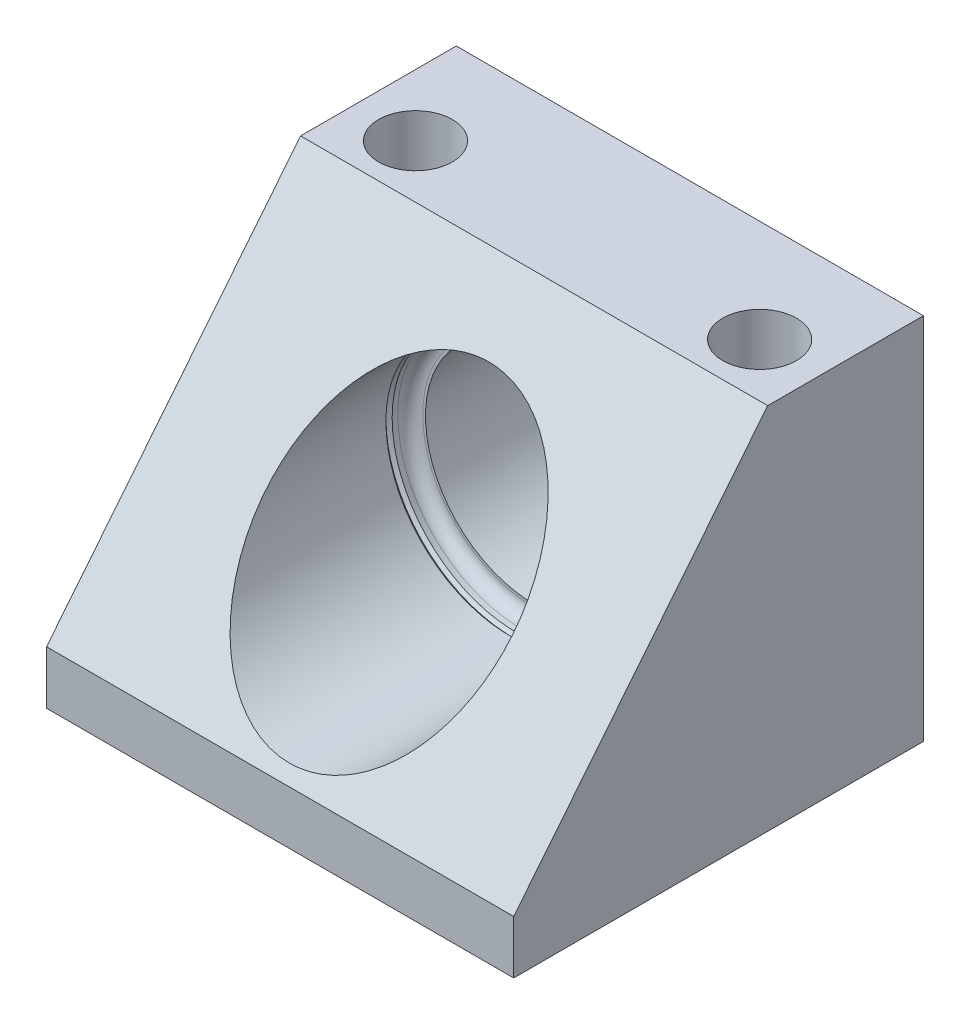
ISO-10303-21;
HEADER;
FILE_DESCRIPTION(('STEP AP214'),'2;1');
FILE_NAME('part.step','',(''),(''),'','','');
FILE_SCHEMA(('AUTOMOTIVE_DESIGN { 1 0 10303 214 1 1 1 1 }'));
ENDSEC;
DATA;
#1=APPLICATION_CONTEXT('core data for automotive mechanical design processes');
#2=APPLICATION_PROTOCOL_DEFINITION('international standard','automotive_design',2000,#1);
#3=PRODUCT_CONTEXT('',#1,'mechanical');
#4=PRODUCT('Part','Part','',(#3));
#5=PRODUCT_RELATED_PRODUCT_CATEGORY('part','',(#4));
#6=PRODUCT_DEFINITION_FORMATION('','',#4);
#7=PRODUCT_DEFINITION_CONTEXT('part definition',#1,'design');
#8=PRODUCT_DEFINITION('design','',#6,#7);
#9=PRODUCT_DEFINITION_SHAPE('','',#8);
#10=(LENGTH_UNIT() NAMED_UNIT(*) SI_UNIT(.MILLI.,.METRE.));
#11=(NAMED_UNIT(*) PLANE_ANGLE_UNIT() SI_UNIT($,.RADIAN.));
#12=(NAMED_UNIT(*) SI_UNIT($,.STERADIAN.) SOLID_ANGLE_UNIT());
#13=UNCERTAINTY_MEASURE_WITH_UNIT(LENGTH_MEASURE(1.E-05),#10,'distance_accuracy_value','');
#14=(GEOMETRIC_REPRESENTATION_CONTEXT(3) GLOBAL_UNCERTAINTY_ASSIGNED_CONTEXT((#13)) GLOBAL_UNIT_ASSIGNED_CONTEXT((#10,
#11,#12)) REPRESENTATION_CONTEXT('',''));
#15=CARTESIAN_POINT('',(0.,0.,0.));
#16=DIRECTION('',(0.,0.,1.));
#17=DIRECTION('',(1.,0.,0.));
#18=AXIS2_PLACEMENT_3D('',#15,#16,#17);
#19=CARTESIAN_POINT('',(28.4988,23.0124,-49.9872));
#20=DIRECTION('',(0.,0.,1.));
#21=DIRECTION('',(1.,0.,0.));
#22=AXIS2_PLACEMENT_3D('',#19,#20,#21);
#23=CYLINDRICAL_SURFACE('',#22,13.259);
#24=CARTESIAN_POINT('',(28.4988,23.0124,-30.988));
#25=DIRECTION('',(0.,0.,1.));
#26=DIRECTION('',(1.,0.,0.));
#27=AXIS2_PLACEMENT_3D('',#24,#25,#26);
#28=CIRCLE('',#27,13.259);
#29=CARTESIAN_POINT('',(41.7578,23.0124,-30.988));
#30=VERTEX_POINT('',#29);
#31=EDGE_CURVE('E119',#30,#30,#28,.F.);
#32=ORIENTED_EDGE('',*,*,#31,.F.);
#33=EDGE_LOOP('',(#32));
#34=FACE_BOUND('',#33,.T.);
#35=CARTESIAN_POINT('',(28.4988,23.0124,-48.8952));
#36=DIRECTION('',(0.,0.,1.));
#37=DIRECTION('',(1.,0.,0.));
#38=AXIS2_PLACEMENT_3D('',#35,#36,#37);
#39=CIRCLE('',#38,13.259);
#40=CARTESIAN_POINT('',(41.7578,23.0124,-48.8952));
#41=VERTEX_POINT('',#40);
#42=EDGE_CURVE('E204',#41,#41,#39,.T.);
#43=ORIENTED_EDGE('',*,*,#42,.F.);
#44=EDGE_LOOP('',(#43));
#45=FACE_BOUND('',#44,.T.);
#46=ADVANCED_FACE('F35',(#34,#45),#23,.F.);
#47=CARTESIAN_POINT('',(0.,44.9834,-49.9872));
#48=DIRECTION('',(0.,0.,1.));
#49=DIRECTION('',(1.,0.,0.));
#50=AXIS2_PLACEMENT_3D('',#47,#48,#49);
#51=PLANE('',#50);
#52=DIRECTION('',(0.,-1.,0.));
#53=VECTOR('',#52,1.);
#54=CARTESIAN_POINT('',(0.,44.9834,-49.9872));
#55=LINE('',#54,#53);
#56=CARTESIAN_POINT('',(0.,44.9834,-49.9872));
#57=VERTEX_POINT('',#56);
#58=CARTESIAN_POINT('',(0.,0.,-49.9872));
#59=VERTEX_POINT('',#58);
#60=EDGE_CURVE('E128',#57,#59,#55,.T.);
#61=ORIENTED_EDGE('',*,*,#60,.F.);
#62=DIRECTION('',(-1.,0.,0.));
#63=VECTOR('',#62,1.);
#64=CARTESIAN_POINT('',(0.,44.9834,-49.9872));
#65=LINE('',#64,#63);
#66=CARTESIAN_POINT('',(56.9976,44.9834,-49.9872));
#67=VERTEX_POINT('',#66);
#68=EDGE_CURVE('E105',#67,#57,#65,.T.);
#69=ORIENTED_EDGE('',*,*,#68,.F.);
#70=DIRECTION('',(0.,1.,0.));
#71=VECTOR('',#70,1.);
#72=CARTESIAN_POINT('',(56.9976,44.9834,-49.9872));
#73=LINE('',#72,#71);
#74=CARTESIAN_POINT('',(56.9976,0.,-49.9872));
#75=VERTEX_POINT('',#74);
#76=EDGE_CURVE('E132',#75,#67,#73,.T.);
#77=ORIENTED_EDGE('',*,*,#76,.F.);
#78=DIRECTION('',(1.,0.,0.));
#79=VECTOR('',#78,1.);
#80=CARTESIAN_POINT('',(0.,0.,-49.9872));
#81=LINE('',#80,#79);
#82=EDGE_CURVE('E130',#59,#75,#81,.T.);
#83=ORIENTED_EDGE('',*,*,#82,.F.);
#84=EDGE_LOOP('',(#61,#69,#77,#83));
#85=FACE_BOUND('',#84,.T.);
#86=CARTESIAN_POINT('',(28.4988,23.0124,-49.9872));
#87=DIRECTION('',(0.,0.,1.));
#88=DIRECTION('',(1.,0.,0.));
#89=AXIS2_PLACEMENT_3D('',#86,#87,#88);
#90=CIRCLE('',#89,14.351);
#91=CARTESIAN_POINT('',(42.8498,23.0124,-49.9872));
#92=VERTEX_POINT('',#91);
#93=EDGE_CURVE('E201',#92,#92,#90,.T.);
#94=ORIENTED_EDGE('',*,*,#93,.T.);
#95=EDGE_LOOP('',(#94));
#96=FACE_BOUND('',#95,.T.);
#97=ADVANCED_FACE('F145',(#85,#96),#51,.F.);
#98=CARTESIAN_POINT('',(28.4988,23.0124,-92.7332191362892));
#99=DIRECTION('',(0.,0.,1.));
#100=DIRECTION('',(1.,0.,0.));
#101=AXIS2_PLACEMENT_3D('',#98,#99,#100);
#102=CYLINDRICAL_SURFACE('',#101,15.113);
#103=CARTESIAN_POINT('',(28.4988,23.0124,-13.2951815181518));
#104=DIRECTION('',(0.,-0.627199621354258,-0.77885854618992));
#105=DIRECTION('',(0.,-0.77885854618992,0.627199621354258));
#106=AXIS2_PLACEMENT_3D('',#103,#104,#105);
#107=ELLIPSE('',#106,19.4040369383259,15.113);
#108=CARTESIAN_POINT('',(28.4988,7.8994,-1.12497689768976));
#109=VERTEX_POINT('',#108);
#110=EDGE_CURVE('E116',#109,#109,#107,.F.);
#111=ORIENTED_EDGE('',*,*,#110,.T.);
#112=EDGE_LOOP('',(#111));
#113=FACE_BOUND('',#112,.T.);
#114=CARTESIAN_POINT('',(28.4988,23.0124,-28.0162));
#115=DIRECTION('',(0.,0.,1.));
#116=DIRECTION('',(1.,0.,0.));
#117=AXIS2_PLACEMENT_3D('',#114,#115,#116);
#118=CIRCLE('',#117,15.113);
#119=CARTESIAN_POINT('',(43.6118,23.0124,-28.0162));
#120=VERTEX_POINT('',#119);
#121=EDGE_CURVE('E198',#120,#120,#118,.T.);
#122=ORIENTED_EDGE('',*,*,#121,.F.);
#123=EDGE_LOOP('',(#122));
#124=FACE_BOUND('',#123,.T.);
#125=ADVANCED_FACE('F166',(#113,#124),#102,.F.);
#126=CARTESIAN_POINT('',(28.4988,23.0124,-29.464));
#127=DIRECTION('',(0.,0.,1.));
#128=DIRECTION('',(1.,0.,0.));
#129=AXIS2_PLACEMENT_3D('',#126,#127,#128);
#130=CIRCLE('',#129,15.113);
#131=CARTESIAN_POINT('',(43.6118,23.0124,-29.464));
#132=VERTEX_POINT('',#131);
#133=EDGE_CURVE('E12',#132,#132,#130,.F.);
#134=ORIENTED_EDGE('',*,*,#133,.T.);
#135=EDGE_LOOP('',(#134));
#136=FACE_BOUND('',#135,.T.);
#137=CARTESIAN_POINT('',(28.4988,23.0124,-28.7782));
#138=DIRECTION('',(0.,0.,1.));
#139=DIRECTION('',(1.,0.,0.));
#140=AXIS2_PLACEMENT_3D('',#137,#138,#139);
#141=CIRCLE('',#140,15.113);
#142=CARTESIAN_POINT('',(43.6118,23.0124,-28.7782));
#143=VERTEX_POINT('',#142);
#144=EDGE_CURVE('E195',#143,#143,#141,.T.);
#145=ORIENTED_EDGE('',*,*,#144,.T.);
#146=EDGE_LOOP('',(#145));
#147=FACE_BOUND('',#146,.T.);
#148=ADVANCED_FACE('F234',(#136,#147),#102,.F.);
#149=CARTESIAN_POINT('',(0.,44.9834,-30.988));
#150=DIRECTION('',(0.,-0.627199621354258,-0.77885854618992));
#151=DIRECTION('',(0.,0.77885854618992,-0.627199621354258));
#152=AXIS2_PLACEMENT_3D('',#149,#150,#151);
#153=PLANE('',#152);
#154=DIRECTION('',(0.,0.778858546189919,-0.627199621354258));
#155=VECTOR('',#154,1.);
#156=CARTESIAN_POINT('',(56.9976,44.9834,-30.988));
#157=LINE('',#156,#155);
#158=CARTESIAN_POINT('',(56.9976,6.5024,0.));
#159=VERTEX_POINT('',#158);
#160=CARTESIAN_POINT('',(56.9976,44.9834,-30.988));
#161=VERTEX_POINT('',#160);
#162=EDGE_CURVE('E93',#159,#161,#157,.T.);
#163=ORIENTED_EDGE('',*,*,#162,.T.);
#164=DIRECTION('',(1.,0.,0.));
#165=VECTOR('',#164,1.);
#166=CARTESIAN_POINT('',(0.,44.9834,-30.988));
#167=LINE('',#166,#165);
#168=CARTESIAN_POINT('',(0.,44.9834,-30.988));
#169=VERTEX_POINT('',#168);
#170=EDGE_CURVE('E89',#169,#161,#167,.T.);
#171=ORIENTED_EDGE('',*,*,#170,.F.);
#172=DIRECTION('',(0.,0.778858546189919,-0.627199621354258));
#173=VECTOR('',#172,1.);
#174=CARTESIAN_POINT('',(0.,44.9834,-30.988));
#175=LINE('',#174,#173);
#176=CARTESIAN_POINT('',(0.,6.50240000000002,0.));
#177=VERTEX_POINT('',#176);
#178=EDGE_CURVE('E50',#177,#169,#175,.T.);
#179=ORIENTED_EDGE('',*,*,#178,.F.);
#180=DIRECTION('',(1.,0.,0.));
#181=VECTOR('',#180,1.);
#182=CARTESIAN_POINT('',(0.,6.50240000000001,0.));
#183=LINE('',#182,#181);
#184=EDGE_CURVE('E97',#177,#159,#183,.T.);
#185=ORIENTED_EDGE('',*,*,#184,.T.);
#186=EDGE_LOOP('',(#163,#171,#179,#185));
#187=FACE_BOUND('',#186,.T.);
#188=ORIENTED_EDGE('',*,*,#110,.F.);
#189=EDGE_LOOP('',(#188));
#190=FACE_BOUND('',#189,.T.);
#191=ADVANCED_FACE('F90',(#187,#190),#153,.F.);
#192=CARTESIAN_POINT('',(0.,44.9834,-49.9872));
#193=DIRECTION('',(-1.,0.,0.));
#194=DIRECTION('',(0.,-1.,0.));
#195=AXIS2_PLACEMENT_3D('',#192,#193,#194);
#196=PLANE('',#195);
#197=ORIENTED_EDGE('',*,*,#178,.T.);
#198=DIRECTION('',(0.,0.,1.));
#199=VECTOR('',#198,1.);
#200=CARTESIAN_POINT('',(0.,44.9834,-49.9872));
#201=LINE('',#200,#199);
#202=EDGE_CURVE('E58',#57,#169,#201,.T.);
#203=ORIENTED_EDGE('',*,*,#202,.F.);
#204=ORIENTED_EDGE('',*,*,#60,.T.);
#205=DIRECTION('',(0.,0.,1.));
#206=VECTOR('',#205,1.);
#207=CARTESIAN_POINT('',(0.,0.,-49.9872));
#208=LINE('',#207,#206);
#209=CARTESIAN_POINT('',(0.,0.,0.));
#210=VERTEX_POINT('',#209);
#211=EDGE_CURVE('E80',#59,#210,#208,.T.);
#212=ORIENTED_EDGE('',*,*,#211,.T.);
#213=DIRECTION('',(0.,-1.,0.));
#214=VECTOR('',#213,1.);
#215=CARTESIAN_POINT('',(0.,44.9834,0.));
#216=LINE('',#215,#214);
#217=EDGE_CURVE('E96',#177,#210,#216,.T.);
#218=ORIENTED_EDGE('',*,*,#217,.F.);
#219=EDGE_LOOP('',(#197,#203,#204,#212,#218));
#220=FACE_BOUND('',#219,.T.);
#221=ADVANCED_FACE('F100',(#220),#196,.T.);
#222=CARTESIAN_POINT('',(0.,44.9834,-49.9872));
#223=DIRECTION('',(0.,1.,0.));
#224=DIRECTION('',(-1.,0.,0.));
#225=AXIS2_PLACEMENT_3D('',#222,#223,#224);
#226=PLANE('',#225);
#227=CARTESIAN_POINT('',(7.51840000000001,44.9834,-37.4904));
#228=DIRECTION('',(0.,1.,0.));
#229=DIRECTION('',(0.,0.,1.));
#230=AXIS2_PLACEMENT_3D('',#227,#228,#229);
#231=CIRCLE('',#230,4.49580000000001);
#232=CARTESIAN_POINT('',(7.51840000000001,44.9834,-32.9946));
#233=VERTEX_POINT('',#232);
#234=EDGE_CURVE('E180',#233,#233,#231,.T.);
#235=ORIENTED_EDGE('',*,*,#234,.F.);
#236=EDGE_LOOP('',(#235));
#237=FACE_BOUND('',#236,.T.);
#238=CARTESIAN_POINT('',(49.5046,44.9834,-37.4904));
#239=DIRECTION('',(0.,1.,0.));
#240=DIRECTION('',(0.,0.,1.));
#241=AXIS2_PLACEMENT_3D('',#238,#239,#240);
#242=CIRCLE('',#241,4.49580000000002);
#243=CARTESIAN_POINT('',(49.5046,44.9834,-32.9946));
#244=VERTEX_POINT('',#243);
#245=EDGE_CURVE('E183',#244,#244,#242,.T.);
#246=ORIENTED_EDGE('',*,*,#245,.F.);
#247=EDGE_LOOP('',(#246));
#248=FACE_BOUND('',#247,.T.);
#249=ORIENTED_EDGE('',*,*,#170,.T.);
#250=DIRECTION('',(0.,0.,1.));
#251=VECTOR('',#250,1.);
#252=CARTESIAN_POINT('',(56.9976,44.9834,-49.9872));
#253=LINE('',#252,#251);
#254=EDGE_CURVE('E106',#67,#161,#253,.T.);
#255=ORIENTED_EDGE('',*,*,#254,.F.);
#256=ORIENTED_EDGE('',*,*,#68,.T.);
#257=ORIENTED_EDGE('',*,*,#202,.T.);
#258=EDGE_LOOP('',(#249,#255,#256,#257));
#259=FACE_BOUND('',#258,.T.);
#260=ADVANCED_FACE('F103',(#237,#248,#259),#226,.T.);
#261=CARTESIAN_POINT('',(56.9976,44.9834,-49.9872));
#262=DIRECTION('',(1.,0.,0.));
#263=DIRECTION('',(0.,0.,-1.));
#264=AXIS2_PLACEMENT_3D('',#261,#262,#263);
#265=PLANE('',#264);
#266=ORIENTED_EDGE('',*,*,#162,.F.);
#267=DIRECTION('',(0.,1.,0.));
#268=VECTOR('',#267,1.);
#269=CARTESIAN_POINT('',(56.9976,44.9834,0.));
#270=LINE('',#269,#268);
#271=CARTESIAN_POINT('',(56.9976,0.,0.));
#272=VERTEX_POINT('',#271);
#273=EDGE_CURVE('E111',#272,#159,#270,.T.);
#274=ORIENTED_EDGE('',*,*,#273,.F.);
#275=DIRECTION('',(0.,0.,1.));
#276=VECTOR('',#275,1.);
#277=CARTESIAN_POINT('',(56.9976,0.,-49.9872));
#278=LINE('',#277,#276);
#279=EDGE_CURVE('E75',#75,#272,#278,.T.);
#280=ORIENTED_EDGE('',*,*,#279,.F.);
#281=ORIENTED_EDGE('',*,*,#76,.T.);
#282=ORIENTED_EDGE('',*,*,#254,.T.);
#283=EDGE_LOOP('',(#266,#274,#280,#281,#282));
#284=FACE_BOUND('',#283,.T.);
#285=ADVANCED_FACE('F142',(#284),#265,.T.);
#286=CARTESIAN_POINT('',(0.,0.,-49.9872));
#287=DIRECTION('',(0.,-1.,0.));
#288=DIRECTION('',(0.,0.,-1.));
#289=AXIS2_PLACEMENT_3D('',#286,#287,#288);
#290=PLANE('',#289);
#291=CARTESIAN_POINT('',(7.51840000000001,0.,-37.4904));
#292=DIRECTION('',(0.,-1.,0.));
#293=DIRECTION('',(0.,0.,-1.));
#294=AXIS2_PLACEMENT_3D('',#291,#292,#293);
#295=CIRCLE('',#294,4.49580000000001);
#296=CARTESIAN_POINT('',(7.51840000000001,0.,-41.9862));
#297=VERTEX_POINT('',#296);
#298=EDGE_CURVE('E185',#297,#297,#295,.T.);
#299=ORIENTED_EDGE('',*,*,#298,.F.);
#300=EDGE_LOOP('',(#299));
#301=FACE_BOUND('',#300,.T.);
#302=CARTESIAN_POINT('',(49.5046,0.,-37.4904));
#303=DIRECTION('',(0.,-1.,0.));
#304=DIRECTION('',(0.,0.,-1.));
#305=AXIS2_PLACEMENT_3D('',#302,#303,#304);
#306=CIRCLE('',#305,4.49580000000001);
#307=CARTESIAN_POINT('',(49.5046,0.,-41.9862));
#308=VERTEX_POINT('',#307);
#309=EDGE_CURVE('E120',#308,#308,#306,.T.);
#310=ORIENTED_EDGE('',*,*,#309,.F.);
#311=EDGE_LOOP('',(#310));
#312=FACE_BOUND('',#311,.T.);
#313=DIRECTION('',(1.,0.,0.));
#314=VECTOR('',#313,1.);
#315=CARTESIAN_POINT('',(0.,0.,0.));
#316=LINE('',#315,#314);
#317=EDGE_CURVE('E136',#210,#272,#316,.T.);
#318=ORIENTED_EDGE('',*,*,#317,.F.);
#319=ORIENTED_EDGE('',*,*,#211,.F.);
#320=ORIENTED_EDGE('',*,*,#82,.T.);
#321=ORIENTED_EDGE('',*,*,#279,.T.);
#322=EDGE_LOOP('',(#318,#319,#320,#321));
#323=FACE_BOUND('',#322,.T.);
#324=ADVANCED_FACE('F147',(#301,#312,#323),#290,.T.);
#325=CARTESIAN_POINT('',(0.,44.9834,0.));
#326=DIRECTION('',(0.,0.,1.));
#327=DIRECTION('',(1.,0.,0.));
#328=AXIS2_PLACEMENT_3D('',#325,#326,#327);
#329=PLANE('',#328);
#330=ORIENTED_EDGE('',*,*,#184,.F.);
#331=ORIENTED_EDGE('',*,*,#217,.T.);
#332=ORIENTED_EDGE('',*,*,#317,.T.);
#333=ORIENTED_EDGE('',*,*,#273,.T.);
#334=EDGE_LOOP('',(#330,#331,#332,#333));
#335=FACE_BOUND('',#334,.T.);
#336=ADVANCED_FACE('F140',(#335),#329,.T.);
#337=CARTESIAN_POINT('',(0.,44.9834,-30.988));
#338=DIRECTION('',(0.,0.,1.));
#339=DIRECTION('',(1.,0.,0.));
#340=AXIS2_PLACEMENT_3D('',#337,#338,#339);
#341=PLANE('',#340);
#342=CARTESIAN_POINT('',(28.4988,23.0124,-30.988));
#343=DIRECTION('',(0.,0.,1.));
#344=DIRECTION('',(1.,0.,0.));
#345=AXIS2_PLACEMENT_3D('',#342,#343,#344);
#346=CIRCLE('',#345,13.589);
#347=CARTESIAN_POINT('',(42.0878,23.0124,-30.988));
#348=VERTEX_POINT('',#347);
#349=EDGE_CURVE('E43',#348,#348,#346,.T.);
#350=ORIENTED_EDGE('',*,*,#349,.T.);
#351=EDGE_LOOP('',(#350));
#352=FACE_BOUND('',#351,.T.);
#353=ORIENTED_EDGE('',*,*,#31,.T.);
#354=EDGE_LOOP('',(#353));
#355=FACE_BOUND('',#354,.T.);
#356=ADVANCED_FACE('F155',(#352,#355),#341,.T.);
#357=CARTESIAN_POINT('',(28.4988,23.0124,-29.464));
#358=DIRECTION('',(0.,0.,1.));
#359=DIRECTION('',(1.,0.,0.));
#360=AXIS2_PLACEMENT_3D('',#357,#358,#359);
#361=TOROIDAL_SURFACE('',#360,13.589,1.524);
#362=ORIENTED_EDGE('',*,*,#133,.F.);
#363=EDGE_LOOP('',(#362));
#364=FACE_BOUND('',#363,.T.);
#365=ORIENTED_EDGE('',*,*,#349,.F.);
#366=EDGE_LOOP('',(#365));
#367=FACE_BOUND('',#366,.T.);
#368=ADVANCED_FACE('F37',(#364,#367),#361,.F.);
#369=CARTESIAN_POINT('',(49.5046,44.9834,-37.4904));
#370=DIRECTION('',(0.,1.,0.));
#371=DIRECTION('',(0.,0.,1.));
#372=AXIS2_PLACEMENT_3D('',#369,#370,#371);
#373=CYLINDRICAL_SURFACE('',#372,4.49580000000001);
#374=ORIENTED_EDGE('',*,*,#245,.T.);
#375=EDGE_LOOP('',(#374));
#376=FACE_BOUND('',#375,.T.);
#377=ORIENTED_EDGE('',*,*,#309,.T.);
#378=EDGE_LOOP('',(#377));
#379=FACE_BOUND('',#378,.T.);
#380=ADVANCED_FACE('F227',(#376,#379),#373,.F.);
#381=CARTESIAN_POINT('',(7.51840000000001,44.9834,-37.4904));
#382=DIRECTION('',(0.,1.,0.));
#383=DIRECTION('',(0.,0.,1.));
#384=AXIS2_PLACEMENT_3D('',#381,#382,#383);
#385=CYLINDRICAL_SURFACE('',#384,4.49580000000001);
#386=ORIENTED_EDGE('',*,*,#234,.T.);
#387=EDGE_LOOP('',(#386));
#388=FACE_BOUND('',#387,.T.);
#389=ORIENTED_EDGE('',*,*,#298,.T.);
#390=EDGE_LOOP('',(#389));
#391=FACE_BOUND('',#390,.T.);
#392=ADVANCED_FACE('F223',(#388,#391),#385,.F.);
#393=CARTESIAN_POINT('',(28.4988,23.0124,-28.3972));
#394=DIRECTION('',(0.,0.,-1.));
#395=DIRECTION('',(-1.,0.,0.));
#396=AXIS2_PLACEMENT_3D('',#393,#394,#395);
#397=CONICAL_SURFACE('',#396,15.494,0.785398163397462);
#398=ORIENTED_EDGE('',*,*,#121,.T.);
#399=EDGE_LOOP('',(#398));
#400=FACE_BOUND('',#399,.T.);
#401=CARTESIAN_POINT('',(28.4988,23.0124,-28.3972));
#402=DIRECTION('',(0.,0.,1.));
#403=DIRECTION('',(1.,0.,0.));
#404=AXIS2_PLACEMENT_3D('',#401,#402,#403);
#405=CIRCLE('',#404,15.494);
#406=CARTESIAN_POINT('',(43.9928,23.0124,-28.3972));
#407=VERTEX_POINT('',#406);
#408=EDGE_CURVE('E192',#407,#407,#405,.T.);
#409=ORIENTED_EDGE('',*,*,#408,.F.);
#410=EDGE_LOOP('',(#409));
#411=FACE_BOUND('',#410,.T.);
#412=ADVANCED_FACE('F217',(#400,#411),#397,.F.);
#413=CARTESIAN_POINT('',(28.4988,23.0124,-28.7782));
#414=DIRECTION('',(0.,0.,1.));
#415=DIRECTION('',(1.,0.,0.));
#416=AXIS2_PLACEMENT_3D('',#413,#414,#415);
#417=CONICAL_SURFACE('',#416,15.113,0.785398163397444);
#418=ORIENTED_EDGE('',*,*,#408,.T.);
#419=EDGE_LOOP('',(#418));
#420=FACE_BOUND('',#419,.T.);
#421=ORIENTED_EDGE('',*,*,#144,.F.);
#422=EDGE_LOOP('',(#421));
#423=FACE_BOUND('',#422,.T.);
#424=ADVANCED_FACE('F211',(#420,#423),#417,.F.);
#425=CARTESIAN_POINT('',(28.4988,23.0124,-49.9872));
#426=DIRECTION('',(0.,0.,-1.));
#427=DIRECTION('',(-1.,0.,0.));
#428=AXIS2_PLACEMENT_3D('',#425,#426,#427);
#429=CONICAL_SURFACE('',#428,14.351,0.785398163397441);
#430=ORIENTED_EDGE('',*,*,#42,.T.);
#431=EDGE_LOOP('',(#430));
#432=FACE_BOUND('',#431,.T.);
#433=ORIENTED_EDGE('',*,*,#93,.F.);
#434=EDGE_LOOP('',(#433));
#435=FACE_BOUND('',#434,.T.);
#436=ADVANCED_FACE('F208',(#432,#435),#429,.F.);
#437=CLOSED_SHELL('',(#46,#97,#125,#148,#191,#221,#260,#285,#324,#336,#356,#368,#380,#392,#412,
#424,#436));
#438=MANIFOLD_SOLID_BREP('B2',#437);
#439=ADVANCED_BREP_SHAPE_REPRESENTATION('',(#18,#438),#14);
#440=SHAPE_DEFINITION_REPRESENTATION(#9,#439);
ENDSEC;
END-ISO-10303-21;
